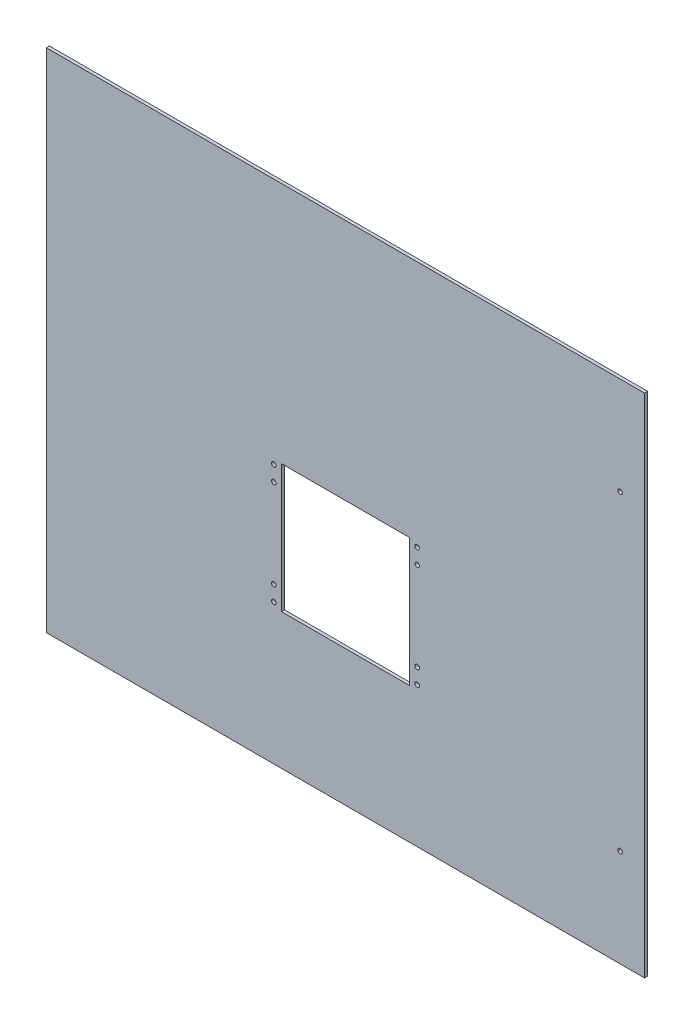
ISO-10303-21;
HEADER;
FILE_DESCRIPTION(('STEP AP214'),'2;1');
FILE_NAME('part.step','',(''),(''),'','','');
FILE_SCHEMA(('AUTOMOTIVE_DESIGN { 1 0 10303 214 1 1 1 1 }'));
ENDSEC;
DATA;
#1=APPLICATION_CONTEXT('core data for automotive mechanical design processes');
#2=APPLICATION_PROTOCOL_DEFINITION('international standard','automotive_design',2000,#1);
#3=PRODUCT_CONTEXT('',#1,'mechanical');
#4=PRODUCT('Part','Part','',(#3));
#5=PRODUCT_RELATED_PRODUCT_CATEGORY('part','',(#4));
#6=PRODUCT_DEFINITION_FORMATION('','',#4);
#7=PRODUCT_DEFINITION_CONTEXT('part definition',#1,'design');
#8=PRODUCT_DEFINITION('design','',#6,#7);
#9=PRODUCT_DEFINITION_SHAPE('','',#8);
#10=(LENGTH_UNIT() NAMED_UNIT(*) SI_UNIT(.MILLI.,.METRE.));
#11=(NAMED_UNIT(*) PLANE_ANGLE_UNIT() SI_UNIT($,.RADIAN.));
#12=(NAMED_UNIT(*) SI_UNIT($,.STERADIAN.) SOLID_ANGLE_UNIT());
#13=UNCERTAINTY_MEASURE_WITH_UNIT(LENGTH_MEASURE(1.E-05),#10,'distance_accuracy_value','');
#14=(GEOMETRIC_REPRESENTATION_CONTEXT(3) GLOBAL_UNCERTAINTY_ASSIGNED_CONTEXT((#13)) GLOBAL_UNIT_ASSIGNED_CONTEXT((#10,
#11,#12)) REPRESENTATION_CONTEXT('',''));
#15=CARTESIAN_POINT('',(0.,0.,0.));
#16=DIRECTION('',(0.,0.,1.));
#17=DIRECTION('',(1.,0.,0.));
#18=AXIS2_PLACEMENT_3D('',#15,#16,#17);
#19=CARTESIAN_POINT('',(0.,0.,6.35));
#20=DIRECTION('',(0.,0.,1.));
#21=DIRECTION('',(1.,0.,0.));
#22=AXIS2_PLACEMENT_3D('',#19,#20,#21);
#23=PLANE('',#22);
#24=CARTESIAN_POINT('',(571.5,323.85,6.35));
#25=DIRECTION('',(0.,0.,1.));
#26=DIRECTION('',(1.,0.,0.));
#27=AXIS2_PLACEMENT_3D('',#24,#25,#26);
#28=CIRCLE('',#27,4.7625);
#29=CARTESIAN_POINT('',(576.2625,323.85,6.35));
#30=VERTEX_POINT('',#29);
#31=EDGE_CURVE('E136',#30,#30,#28,.F.);
#32=ORIENTED_EDGE('',*,*,#31,.T.);
#33=EDGE_LOOP('',(#32));
#34=FACE_BOUND('',#33,.T.);
#35=CARTESIAN_POINT('',(571.5,-323.85,6.35));
#36=DIRECTION('',(0.,0.,1.));
#37=DIRECTION('',(1.,0.,0.));
#38=AXIS2_PLACEMENT_3D('',#35,#36,#37);
#39=CIRCLE('',#38,4.7625);
#40=CARTESIAN_POINT('',(576.2625,-323.85,6.35));
#41=VERTEX_POINT('',#40);
#42=EDGE_CURVE('E139',#41,#41,#39,.F.);
#43=ORIENTED_EDGE('',*,*,#42,.T.);
#44=EDGE_LOOP('',(#43));
#45=FACE_BOUND('',#44,.T.);
#46=CARTESIAN_POINT('',(149.225,-19.05,6.35));
#47=DIRECTION('',(0.,0.,-1.));
#48=DIRECTION('',(-1.,0.,0.));
#49=AXIS2_PLACEMENT_3D('',#46,#47,#48);
#50=CIRCLE('',#49,4.7625);
#51=CARTESIAN_POINT('',(144.4625,-19.05,6.35));
#52=VERTEX_POINT('',#51);
#53=EDGE_CURVE('E142',#52,#52,#50,.T.);
#54=ORIENTED_EDGE('',*,*,#53,.T.);
#55=EDGE_LOOP('',(#54));
#56=FACE_BOUND('',#55,.T.);
#57=CARTESIAN_POINT('',(149.225,12.7,6.35));
#58=DIRECTION('',(0.,0.,-1.));
#59=DIRECTION('',(-1.,0.,0.));
#60=AXIS2_PLACEMENT_3D('',#57,#58,#59);
#61=CIRCLE('',#60,4.7625);
#62=CARTESIAN_POINT('',(144.4625,12.7,6.35));
#63=VERTEX_POINT('',#62);
#64=EDGE_CURVE('E145',#63,#63,#61,.T.);
#65=ORIENTED_EDGE('',*,*,#64,.T.);
#66=EDGE_LOOP('',(#65));
#67=FACE_BOUND('',#66,.T.);
#68=CARTESIAN_POINT('',(149.225,-203.2,6.35));
#69=DIRECTION('',(0.,0.,-1.));
#70=DIRECTION('',(-1.,0.,0.));
#71=AXIS2_PLACEMENT_3D('',#68,#69,#70);
#72=CIRCLE('',#71,4.7625);
#73=CARTESIAN_POINT('',(144.4625,-203.2,6.35));
#74=VERTEX_POINT('',#73);
#75=EDGE_CURVE('E148',#74,#74,#72,.T.);
#76=ORIENTED_EDGE('',*,*,#75,.T.);
#77=EDGE_LOOP('',(#76));
#78=FACE_BOUND('',#77,.T.);
#79=CARTESIAN_POINT('',(149.225,-234.95,6.35));
#80=DIRECTION('',(0.,0.,-1.));
#81=DIRECTION('',(-1.,0.,0.));
#82=AXIS2_PLACEMENT_3D('',#79,#80,#81);
#83=CIRCLE('',#82,4.7625);
#84=CARTESIAN_POINT('',(144.4625,-234.95,6.35));
#85=VERTEX_POINT('',#84);
#86=EDGE_CURVE('E151',#85,#85,#83,.T.);
#87=ORIENTED_EDGE('',*,*,#86,.T.);
#88=EDGE_LOOP('',(#87));
#89=FACE_BOUND('',#88,.T.);
#90=CARTESIAN_POINT('',(-149.225,-19.05,6.35));
#91=DIRECTION('',(0.,0.,1.));
#92=DIRECTION('',(1.,0.,0.));
#93=AXIS2_PLACEMENT_3D('',#90,#91,#92);
#94=CIRCLE('',#93,4.7625);
#95=CARTESIAN_POINT('',(-144.4625,-19.05,6.35));
#96=VERTEX_POINT('',#95);
#97=EDGE_CURVE('E154',#96,#96,#94,.F.);
#98=ORIENTED_EDGE('',*,*,#97,.T.);
#99=EDGE_LOOP('',(#98));
#100=FACE_BOUND('',#99,.T.);
#101=CARTESIAN_POINT('',(-149.225,12.7,6.35));
#102=DIRECTION('',(0.,0.,1.));
#103=DIRECTION('',(1.,0.,0.));
#104=AXIS2_PLACEMENT_3D('',#101,#102,#103);
#105=CIRCLE('',#104,4.7625);
#106=CARTESIAN_POINT('',(-144.4625,12.7,6.35));
#107=VERTEX_POINT('',#106);
#108=EDGE_CURVE('E157',#107,#107,#105,.F.);
#109=ORIENTED_EDGE('',*,*,#108,.T.);
#110=EDGE_LOOP('',(#109));
#111=FACE_BOUND('',#110,.T.);
#112=CARTESIAN_POINT('',(-149.225,-203.2,6.35));
#113=DIRECTION('',(0.,0.,1.));
#114=DIRECTION('',(1.,0.,0.));
#115=AXIS2_PLACEMENT_3D('',#112,#113,#114);
#116=CIRCLE('',#115,4.7625);
#117=CARTESIAN_POINT('',(-144.4625,-203.2,6.35));
#118=VERTEX_POINT('',#117);
#119=EDGE_CURVE('E159',#118,#118,#116,.F.);
#120=ORIENTED_EDGE('',*,*,#119,.T.);
#121=EDGE_LOOP('',(#120));
#122=FACE_BOUND('',#121,.T.);
#123=CARTESIAN_POINT('',(-149.225,-234.95,6.35));
#124=DIRECTION('',(0.,0.,1.));
#125=DIRECTION('',(1.,0.,0.));
#126=AXIS2_PLACEMENT_3D('',#123,#124,#125);
#127=CIRCLE('',#126,4.7625);
#128=CARTESIAN_POINT('',(-144.4625,-234.95,6.35));
#129=VERTEX_POINT('',#128);
#130=EDGE_CURVE('E20',#129,#129,#127,.F.);
#131=ORIENTED_EDGE('',*,*,#130,.T.);
#132=EDGE_LOOP('',(#131));
#133=FACE_BOUND('',#132,.T.);
#134=DIRECTION('',(1.,0.,0.));
#135=VECTOR('',#134,1.);
#136=CARTESIAN_POINT('',(-133.35,-244.475,6.35));
#137=LINE('',#136,#135);
#138=CARTESIAN_POINT('',(133.35,-244.475,6.35));
#139=VERTEX_POINT('',#138);
#140=CARTESIAN_POINT('',(-133.35,-244.475,6.35));
#141=VERTEX_POINT('',#140);
#142=EDGE_CURVE('E168',#139,#141,#137,.F.);
#143=ORIENTED_EDGE('',*,*,#142,.T.);
#144=DIRECTION('',(0.,1.,0.));
#145=VECTOR('',#144,1.);
#146=CARTESIAN_POINT('',(-133.35,22.225,6.35));
#147=LINE('',#146,#145);
#148=CARTESIAN_POINT('',(-133.35,22.225,6.35));
#149=VERTEX_POINT('',#148);
#150=EDGE_CURVE('E189',#141,#149,#147,.T.);
#151=ORIENTED_EDGE('',*,*,#150,.T.);
#152=DIRECTION('',(1.,0.,0.));
#153=VECTOR('',#152,1.);
#154=CARTESIAN_POINT('',(133.35,22.225,6.35));
#155=LINE('',#154,#153);
#156=CARTESIAN_POINT('',(133.35,22.225,6.35));
#157=VERTEX_POINT('',#156);
#158=EDGE_CURVE('E184',#149,#157,#155,.T.);
#159=ORIENTED_EDGE('',*,*,#158,.T.);
#160=DIRECTION('',(0.,1.,0.));
#161=VECTOR('',#160,1.);
#162=CARTESIAN_POINT('',(133.35,-244.475,6.35));
#163=LINE('',#162,#161);
#164=EDGE_CURVE('E179',#157,#139,#163,.F.);
#165=ORIENTED_EDGE('',*,*,#164,.T.);
#166=EDGE_LOOP('',(#143,#151,#159,#165));
#167=FACE_BOUND('',#166,.T.);
#168=DIRECTION('',(1.,0.,0.));
#169=VECTOR('',#168,1.);
#170=CARTESIAN_POINT('',(622.3,527.05,6.35));
#171=LINE('',#170,#169);
#172=CARTESIAN_POINT('',(-622.3,527.05,6.35));
#173=VERTEX_POINT('',#172);
#174=CARTESIAN_POINT('',(622.3,527.05,6.35));
#175=VERTEX_POINT('',#174);
#176=EDGE_CURVE('E97',#173,#175,#171,.T.);
#177=ORIENTED_EDGE('',*,*,#176,.F.);
#178=DIRECTION('',(0.,1.,0.));
#179=VECTOR('',#178,1.);
#180=CARTESIAN_POINT('',(-622.3,527.05,6.35));
#181=LINE('',#180,#179);
#182=CARTESIAN_POINT('',(-622.3,-527.05,6.35));
#183=VERTEX_POINT('',#182);
#184=EDGE_CURVE('E94',#183,#173,#181,.T.);
#185=ORIENTED_EDGE('',*,*,#184,.F.);
#186=DIRECTION('',(1.,0.,0.));
#187=VECTOR('',#186,1.);
#188=CARTESIAN_POINT('',(-622.3,-527.05,6.35));
#189=LINE('',#188,#187);
#190=CARTESIAN_POINT('',(622.3,-527.05,6.35));
#191=VERTEX_POINT('',#190);
#192=EDGE_CURVE('E85',#191,#183,#189,.F.);
#193=ORIENTED_EDGE('',*,*,#192,.F.);
#194=DIRECTION('',(0.,1.,0.));
#195=VECTOR('',#194,1.);
#196=CARTESIAN_POINT('',(622.3,-527.05,6.35));
#197=LINE('',#196,#195);
#198=EDGE_CURVE('E80',#175,#191,#197,.F.);
#199=ORIENTED_EDGE('',*,*,#198,.F.);
#200=EDGE_LOOP('',(#177,#185,#193,#199));
#201=FACE_BOUND('',#200,.T.);
#202=ADVANCED_FACE('F17',(#34,#45,#56,#67,#78,#89,#100,#111,#122,#133,#167,#201),#23,.T.);
#203=CARTESIAN_POINT('',(-622.3,527.05,0.));
#204=DIRECTION('',(-1.,0.,0.));
#205=DIRECTION('',(0.,0.,1.));
#206=AXIS2_PLACEMENT_3D('',#203,#204,#205);
#207=PLANE('',#206);
#208=DIRECTION('',(0.,0.,1.));
#209=VECTOR('',#208,1.);
#210=CARTESIAN_POINT('',(-622.3,527.05,0.));
#211=LINE('',#210,#209);
#212=CARTESIAN_POINT('',(-622.3,527.05,0.));
#213=VERTEX_POINT('',#212);
#214=EDGE_CURVE('E194',#213,#173,#211,.T.);
#215=ORIENTED_EDGE('',*,*,#214,.F.);
#216=DIRECTION('',(0.,1.,0.));
#217=VECTOR('',#216,1.);
#218=CARTESIAN_POINT('',(-622.3,0.,0.));
#219=LINE('',#218,#217);
#220=CARTESIAN_POINT('',(-622.3,-527.05,0.));
#221=VERTEX_POINT('',#220);
#222=EDGE_CURVE('E104',#213,#221,#219,.F.);
#223=ORIENTED_EDGE('',*,*,#222,.T.);
#224=DIRECTION('',(0.,0.,-1.));
#225=VECTOR('',#224,1.);
#226=CARTESIAN_POINT('',(-622.3,-527.05,0.));
#227=LINE('',#226,#225);
#228=EDGE_CURVE('E90',#183,#221,#227,.T.);
#229=ORIENTED_EDGE('',*,*,#228,.F.);
#230=ORIENTED_EDGE('',*,*,#184,.T.);
#231=EDGE_LOOP('',(#215,#223,#229,#230));
#232=FACE_BOUND('',#231,.T.);
#233=ADVANCED_FACE('F103',(#232),#207,.T.);
#234=CARTESIAN_POINT('',(-622.3,-527.05,0.));
#235=DIRECTION('',(0.,-1.,0.));
#236=DIRECTION('',(0.,0.,-1.));
#237=AXIS2_PLACEMENT_3D('',#234,#235,#236);
#238=PLANE('',#237);
#239=ORIENTED_EDGE('',*,*,#228,.T.);
#240=DIRECTION('',(1.,0.,0.));
#241=VECTOR('',#240,1.);
#242=CARTESIAN_POINT('',(0.,-527.05,0.));
#243=LINE('',#242,#241);
#244=CARTESIAN_POINT('',(622.3,-527.05,0.));
#245=VERTEX_POINT('',#244);
#246=EDGE_CURVE('E202',#221,#245,#243,.T.);
#247=ORIENTED_EDGE('',*,*,#246,.T.);
#248=DIRECTION('',(0.,0.,-1.));
#249=VECTOR('',#248,1.);
#250=CARTESIAN_POINT('',(622.3,-527.05,0.));
#251=LINE('',#250,#249);
#252=EDGE_CURVE('E92',#191,#245,#251,.T.);
#253=ORIENTED_EDGE('',*,*,#252,.F.);
#254=ORIENTED_EDGE('',*,*,#192,.T.);
#255=EDGE_LOOP('',(#239,#247,#253,#254));
#256=FACE_BOUND('',#255,.T.);
#257=ADVANCED_FACE('F87',(#256),#238,.T.);
#258=CARTESIAN_POINT('',(622.3,-527.05,0.));
#259=DIRECTION('',(1.,0.,0.));
#260=DIRECTION('',(0.,0.,-1.));
#261=AXIS2_PLACEMENT_3D('',#258,#259,#260);
#262=PLANE('',#261);
#263=ORIENTED_EDGE('',*,*,#252,.T.);
#264=DIRECTION('',(0.,1.,0.));
#265=VECTOR('',#264,1.);
#266=CARTESIAN_POINT('',(622.3,0.,0.));
#267=LINE('',#266,#265);
#268=CARTESIAN_POINT('',(622.3,527.05,0.));
#269=VERTEX_POINT('',#268);
#270=EDGE_CURVE('E198',#245,#269,#267,.T.);
#271=ORIENTED_EDGE('',*,*,#270,.T.);
#272=DIRECTION('',(0.,0.,1.));
#273=VECTOR('',#272,1.);
#274=CARTESIAN_POINT('',(622.3,527.05,0.));
#275=LINE('',#274,#273);
#276=EDGE_CURVE('E191',#175,#269,#275,.F.);
#277=ORIENTED_EDGE('',*,*,#276,.F.);
#278=ORIENTED_EDGE('',*,*,#198,.T.);
#279=EDGE_LOOP('',(#263,#271,#277,#278));
#280=FACE_BOUND('',#279,.T.);
#281=ADVANCED_FACE('F197',(#280),#262,.T.);
#282=CARTESIAN_POINT('',(622.3,527.05,0.));
#283=DIRECTION('',(0.,1.,0.));
#284=DIRECTION('',(0.,0.,1.));
#285=AXIS2_PLACEMENT_3D('',#282,#283,#284);
#286=PLANE('',#285);
#287=ORIENTED_EDGE('',*,*,#276,.T.);
#288=DIRECTION('',(1.,0.,0.));
#289=VECTOR('',#288,1.);
#290=CARTESIAN_POINT('',(0.,527.05,0.));
#291=LINE('',#290,#289);
#292=EDGE_CURVE('E204',#269,#213,#291,.F.);
#293=ORIENTED_EDGE('',*,*,#292,.T.);
#294=ORIENTED_EDGE('',*,*,#214,.T.);
#295=ORIENTED_EDGE('',*,*,#176,.T.);
#296=EDGE_LOOP('',(#287,#293,#294,#295));
#297=FACE_BOUND('',#296,.T.);
#298=ADVANCED_FACE('F291',(#297),#286,.T.);
#299=CARTESIAN_POINT('',(-133.35,22.225,6.35));
#300=DIRECTION('',(-1.,0.,0.));
#301=DIRECTION('',(0.,0.,1.));
#302=AXIS2_PLACEMENT_3D('',#299,#300,#301);
#303=PLANE('',#302);
#304=ORIENTED_EDGE('',*,*,#150,.F.);
#305=DIRECTION('',(0.,0.,-1.));
#306=VECTOR('',#305,1.);
#307=CARTESIAN_POINT('',(-133.35,-244.475,6.35));
#308=LINE('',#307,#306);
#309=CARTESIAN_POINT('',(-133.35,-244.475,0.));
#310=VERTEX_POINT('',#309);
#311=EDGE_CURVE('E164',#141,#310,#308,.T.);
#312=ORIENTED_EDGE('',*,*,#311,.T.);
#313=DIRECTION('',(0.,1.,0.));
#314=VECTOR('',#313,1.);
#315=CARTESIAN_POINT('',(-133.35,0.,0.));
#316=LINE('',#315,#314);
#317=CARTESIAN_POINT('',(-133.35,22.225,0.));
#318=VERTEX_POINT('',#317);
#319=EDGE_CURVE('E208',#310,#318,#316,.T.);
#320=ORIENTED_EDGE('',*,*,#319,.T.);
#321=DIRECTION('',(0.,0.,1.));
#322=VECTOR('',#321,1.);
#323=CARTESIAN_POINT('',(-133.35,22.225,6.35));
#324=LINE('',#323,#322);
#325=EDGE_CURVE('E186',#318,#149,#324,.T.);
#326=ORIENTED_EDGE('',*,*,#325,.T.);
#327=EDGE_LOOP('',(#304,#312,#320,#326));
#328=FACE_BOUND('',#327,.T.);
#329=ADVANCED_FACE('F226',(#328),#303,.F.);
#330=CARTESIAN_POINT('',(133.35,22.225,6.35));
#331=DIRECTION('',(0.,1.,0.));
#332=DIRECTION('',(0.,0.,1.));
#333=AXIS2_PLACEMENT_3D('',#330,#331,#332);
#334=PLANE('',#333);
#335=ORIENTED_EDGE('',*,*,#158,.F.);
#336=ORIENTED_EDGE('',*,*,#325,.F.);
#337=DIRECTION('',(1.,0.,0.));
#338=VECTOR('',#337,1.);
#339=CARTESIAN_POINT('',(0.,22.225,0.));
#340=LINE('',#339,#338);
#341=CARTESIAN_POINT('',(133.35,22.225,0.));
#342=VERTEX_POINT('',#341);
#343=EDGE_CURVE('E210',#318,#342,#340,.T.);
#344=ORIENTED_EDGE('',*,*,#343,.T.);
#345=DIRECTION('',(0.,0.,-1.));
#346=VECTOR('',#345,1.);
#347=CARTESIAN_POINT('',(133.35,22.225,6.35));
#348=LINE('',#347,#346);
#349=EDGE_CURVE('E181',#342,#157,#348,.F.);
#350=ORIENTED_EDGE('',*,*,#349,.T.);
#351=EDGE_LOOP('',(#335,#336,#344,#350));
#352=FACE_BOUND('',#351,.T.);
#353=ADVANCED_FACE('F225',(#352),#334,.F.);
#354=CARTESIAN_POINT('',(133.35,-244.475,6.35));
#355=DIRECTION('',(1.,0.,0.));
#356=DIRECTION('',(0.,0.,-1.));
#357=AXIS2_PLACEMENT_3D('',#354,#355,#356);
#358=PLANE('',#357);
#359=ORIENTED_EDGE('',*,*,#164,.F.);
#360=ORIENTED_EDGE('',*,*,#349,.F.);
#361=DIRECTION('',(0.,1.,0.));
#362=VECTOR('',#361,1.);
#363=CARTESIAN_POINT('',(133.35,0.,0.));
#364=LINE('',#363,#362);
#365=CARTESIAN_POINT('',(133.35,-244.475,0.));
#366=VERTEX_POINT('',#365);
#367=EDGE_CURVE('E213',#342,#366,#364,.F.);
#368=ORIENTED_EDGE('',*,*,#367,.T.);
#369=DIRECTION('',(0.,0.,-1.));
#370=VECTOR('',#369,1.);
#371=CARTESIAN_POINT('',(133.35,-244.475,6.35));
#372=LINE('',#371,#370);
#373=EDGE_CURVE('E35',#366,#139,#372,.F.);
#374=ORIENTED_EDGE('',*,*,#373,.T.);
#375=EDGE_LOOP('',(#359,#360,#368,#374));
#376=FACE_BOUND('',#375,.T.);
#377=ADVANCED_FACE('F222',(#376),#358,.F.);
#378=CARTESIAN_POINT('',(-133.35,-244.475,6.35));
#379=DIRECTION('',(0.,-1.,0.));
#380=DIRECTION('',(0.,0.,-1.));
#381=AXIS2_PLACEMENT_3D('',#378,#379,#380);
#382=PLANE('',#381);
#383=ORIENTED_EDGE('',*,*,#142,.F.);
#384=ORIENTED_EDGE('',*,*,#373,.F.);
#385=DIRECTION('',(1.,0.,0.));
#386=VECTOR('',#385,1.);
#387=CARTESIAN_POINT('',(0.,-244.475,0.));
#388=LINE('',#387,#386);
#389=EDGE_CURVE('E135',#366,#310,#388,.F.);
#390=ORIENTED_EDGE('',*,*,#389,.T.);
#391=ORIENTED_EDGE('',*,*,#311,.F.);
#392=EDGE_LOOP('',(#383,#384,#390,#391));
#393=FACE_BOUND('',#392,.T.);
#394=ADVANCED_FACE('F216',(#393),#382,.F.);
#395=CARTESIAN_POINT('',(-149.225,-234.95,0.));
#396=DIRECTION('',(0.,0.,1.));
#397=DIRECTION('',(1.,0.,0.));
#398=AXIS2_PLACEMENT_3D('',#395,#396,#397);
#399=CYLINDRICAL_SURFACE('',#398,4.7625);
#400=ORIENTED_EDGE('',*,*,#130,.F.);
#401=EDGE_LOOP('',(#400));
#402=FACE_BOUND('',#401,.T.);
#403=CARTESIAN_POINT('',(-149.225,-234.95,0.));
#404=DIRECTION('',(0.,0.,1.));
#405=DIRECTION('',(1.,0.,0.));
#406=AXIS2_PLACEMENT_3D('',#403,#404,#405);
#407=CIRCLE('',#406,4.7625);
#408=CARTESIAN_POINT('',(-144.4625,-234.95,0.));
#409=VERTEX_POINT('',#408);
#410=EDGE_CURVE('E132',#409,#409,#407,.F.);
#411=ORIENTED_EDGE('',*,*,#410,.T.);
#412=EDGE_LOOP('',(#411));
#413=FACE_BOUND('',#412,.T.);
#414=ADVANCED_FACE('F278',(#402,#413),#399,.F.);
#415=CARTESIAN_POINT('',(-149.225,-203.2,0.));
#416=DIRECTION('',(0.,0.,1.));
#417=DIRECTION('',(1.,0.,0.));
#418=AXIS2_PLACEMENT_3D('',#415,#416,#417);
#419=CYLINDRICAL_SURFACE('',#418,4.7625);
#420=ORIENTED_EDGE('',*,*,#119,.F.);
#421=EDGE_LOOP('',(#420));
#422=FACE_BOUND('',#421,.T.);
#423=CARTESIAN_POINT('',(-149.225,-203.2,0.));
#424=DIRECTION('',(0.,0.,1.));
#425=DIRECTION('',(1.,0.,0.));
#426=AXIS2_PLACEMENT_3D('',#423,#424,#425);
#427=CIRCLE('',#426,4.7625);
#428=CARTESIAN_POINT('',(-144.4625,-203.2,0.));
#429=VERTEX_POINT('',#428);
#430=EDGE_CURVE('E129',#429,#429,#427,.F.);
#431=ORIENTED_EDGE('',*,*,#430,.T.);
#432=EDGE_LOOP('',(#431));
#433=FACE_BOUND('',#432,.T.);
#434=ADVANCED_FACE('F274',(#422,#433),#419,.F.);
#435=CARTESIAN_POINT('',(-149.225,12.7,0.));
#436=DIRECTION('',(0.,0.,1.));
#437=DIRECTION('',(1.,0.,0.));
#438=AXIS2_PLACEMENT_3D('',#435,#436,#437);
#439=CYLINDRICAL_SURFACE('',#438,4.7625);
#440=ORIENTED_EDGE('',*,*,#108,.F.);
#441=EDGE_LOOP('',(#440));
#442=FACE_BOUND('',#441,.T.);
#443=CARTESIAN_POINT('',(-149.225,12.7,0.));
#444=DIRECTION('',(0.,0.,1.));
#445=DIRECTION('',(1.,0.,0.));
#446=AXIS2_PLACEMENT_3D('',#443,#444,#445);
#447=CIRCLE('',#446,4.7625);
#448=CARTESIAN_POINT('',(-144.4625,12.7,0.));
#449=VERTEX_POINT('',#448);
#450=EDGE_CURVE('E126',#449,#449,#447,.F.);
#451=ORIENTED_EDGE('',*,*,#450,.T.);
#452=EDGE_LOOP('',(#451));
#453=FACE_BOUND('',#452,.T.);
#454=ADVANCED_FACE('F270',(#442,#453),#439,.F.);
#455=CARTESIAN_POINT('',(-149.225,-19.05,0.));
#456=DIRECTION('',(0.,0.,1.));
#457=DIRECTION('',(1.,0.,0.));
#458=AXIS2_PLACEMENT_3D('',#455,#456,#457);
#459=CYLINDRICAL_SURFACE('',#458,4.7625);
#460=ORIENTED_EDGE('',*,*,#97,.F.);
#461=EDGE_LOOP('',(#460));
#462=FACE_BOUND('',#461,.T.);
#463=CARTESIAN_POINT('',(-149.225,-19.05,0.));
#464=DIRECTION('',(0.,0.,1.));
#465=DIRECTION('',(1.,0.,0.));
#466=AXIS2_PLACEMENT_3D('',#463,#464,#465);
#467=CIRCLE('',#466,4.7625);
#468=CARTESIAN_POINT('',(-144.4625,-19.05,0.));
#469=VERTEX_POINT('',#468);
#470=EDGE_CURVE('E123',#469,#469,#467,.F.);
#471=ORIENTED_EDGE('',*,*,#470,.T.);
#472=EDGE_LOOP('',(#471));
#473=FACE_BOUND('',#472,.T.);
#474=ADVANCED_FACE('F266',(#462,#473),#459,.F.);
#475=CARTESIAN_POINT('',(149.225,-234.95,0.));
#476=DIRECTION('',(0.,0.,-1.));
#477=DIRECTION('',(-1.,0.,0.));
#478=AXIS2_PLACEMENT_3D('',#475,#476,#477);
#479=CYLINDRICAL_SURFACE('',#478,4.7625);
#480=CARTESIAN_POINT('',(149.225,-234.95,0.));
#481=DIRECTION('',(0.,0.,-1.));
#482=DIRECTION('',(-1.,0.,0.));
#483=AXIS2_PLACEMENT_3D('',#480,#481,#482);
#484=CIRCLE('',#483,4.7625);
#485=CARTESIAN_POINT('',(144.4625,-234.95,0.));
#486=VERTEX_POINT('',#485);
#487=EDGE_CURVE('E120',#486,#486,#484,.T.);
#488=ORIENTED_EDGE('',*,*,#487,.T.);
#489=EDGE_LOOP('',(#488));
#490=FACE_BOUND('',#489,.T.);
#491=ORIENTED_EDGE('',*,*,#86,.F.);
#492=EDGE_LOOP('',(#491));
#493=FACE_BOUND('',#492,.T.);
#494=ADVANCED_FACE('F262',(#490,#493),#479,.F.);
#495=CARTESIAN_POINT('',(149.225,-203.2,0.));
#496=DIRECTION('',(0.,0.,-1.));
#497=DIRECTION('',(-1.,0.,0.));
#498=AXIS2_PLACEMENT_3D('',#495,#496,#497);
#499=CYLINDRICAL_SURFACE('',#498,4.7625);
#500=CARTESIAN_POINT('',(149.225,-203.2,0.));
#501=DIRECTION('',(0.,0.,-1.));
#502=DIRECTION('',(-1.,0.,0.));
#503=AXIS2_PLACEMENT_3D('',#500,#501,#502);
#504=CIRCLE('',#503,4.7625);
#505=CARTESIAN_POINT('',(144.4625,-203.2,0.));
#506=VERTEX_POINT('',#505);
#507=EDGE_CURVE('E117',#506,#506,#504,.T.);
#508=ORIENTED_EDGE('',*,*,#507,.T.);
#509=EDGE_LOOP('',(#508));
#510=FACE_BOUND('',#509,.T.);
#511=ORIENTED_EDGE('',*,*,#75,.F.);
#512=EDGE_LOOP('',(#511));
#513=FACE_BOUND('',#512,.T.);
#514=ADVANCED_FACE('F258',(#510,#513),#499,.F.);
#515=CARTESIAN_POINT('',(149.225,12.7,0.));
#516=DIRECTION('',(0.,0.,-1.));
#517=DIRECTION('',(-1.,0.,0.));
#518=AXIS2_PLACEMENT_3D('',#515,#516,#517);
#519=CYLINDRICAL_SURFACE('',#518,4.7625);
#520=CARTESIAN_POINT('',(149.225,12.7,0.));
#521=DIRECTION('',(0.,0.,-1.));
#522=DIRECTION('',(-1.,0.,0.));
#523=AXIS2_PLACEMENT_3D('',#520,#521,#522);
#524=CIRCLE('',#523,4.7625);
#525=CARTESIAN_POINT('',(144.4625,12.7,0.));
#526=VERTEX_POINT('',#525);
#527=EDGE_CURVE('E114',#526,#526,#524,.T.);
#528=ORIENTED_EDGE('',*,*,#527,.T.);
#529=EDGE_LOOP('',(#528));
#530=FACE_BOUND('',#529,.T.);
#531=ORIENTED_EDGE('',*,*,#64,.F.);
#532=EDGE_LOOP('',(#531));
#533=FACE_BOUND('',#532,.T.);
#534=ADVANCED_FACE('F254',(#530,#533),#519,.F.);
#535=CARTESIAN_POINT('',(149.225,-19.05,0.));
#536=DIRECTION('',(0.,0.,-1.));
#537=DIRECTION('',(-1.,0.,0.));
#538=AXIS2_PLACEMENT_3D('',#535,#536,#537);
#539=CYLINDRICAL_SURFACE('',#538,4.7625);
#540=CARTESIAN_POINT('',(149.225,-19.05,0.));
#541=DIRECTION('',(0.,0.,-1.));
#542=DIRECTION('',(-1.,0.,0.));
#543=AXIS2_PLACEMENT_3D('',#540,#541,#542);
#544=CIRCLE('',#543,4.7625);
#545=CARTESIAN_POINT('',(144.4625,-19.05,0.));
#546=VERTEX_POINT('',#545);
#547=EDGE_CURVE('E111',#546,#546,#544,.T.);
#548=ORIENTED_EDGE('',*,*,#547,.T.);
#549=EDGE_LOOP('',(#548));
#550=FACE_BOUND('',#549,.T.);
#551=ORIENTED_EDGE('',*,*,#53,.F.);
#552=EDGE_LOOP('',(#551));
#553=FACE_BOUND('',#552,.T.);
#554=ADVANCED_FACE('F250',(#550,#553),#539,.F.);
#555=CARTESIAN_POINT('',(571.5,-323.85,0.));
#556=DIRECTION('',(0.,0.,1.));
#557=DIRECTION('',(1.,0.,0.));
#558=AXIS2_PLACEMENT_3D('',#555,#556,#557);
#559=CYLINDRICAL_SURFACE('',#558,4.7625);
#560=ORIENTED_EDGE('',*,*,#42,.F.);
#561=EDGE_LOOP('',(#560));
#562=FACE_BOUND('',#561,.T.);
#563=CARTESIAN_POINT('',(571.5,-323.85,0.));
#564=DIRECTION('',(0.,0.,1.));
#565=DIRECTION('',(1.,0.,0.));
#566=AXIS2_PLACEMENT_3D('',#563,#564,#565);
#567=CIRCLE('',#566,4.7625);
#568=CARTESIAN_POINT('',(576.2625,-323.85,0.));
#569=VERTEX_POINT('',#568);
#570=EDGE_CURVE('E26',#569,#569,#567,.F.);
#571=ORIENTED_EDGE('',*,*,#570,.T.);
#572=EDGE_LOOP('',(#571));
#573=FACE_BOUND('',#572,.T.);
#574=ADVANCED_FACE('F242',(#562,#573),#559,.F.);
#575=CARTESIAN_POINT('',(571.5,323.85,0.));
#576=DIRECTION('',(0.,0.,1.));
#577=DIRECTION('',(1.,0.,0.));
#578=AXIS2_PLACEMENT_3D('',#575,#576,#577);
#579=CYLINDRICAL_SURFACE('',#578,4.7625);
#580=ORIENTED_EDGE('',*,*,#31,.F.);
#581=EDGE_LOOP('',(#580));
#582=FACE_BOUND('',#581,.T.);
#583=CARTESIAN_POINT('',(571.5,323.85,0.));
#584=DIRECTION('',(0.,0.,1.));
#585=DIRECTION('',(1.,0.,0.));
#586=AXIS2_PLACEMENT_3D('',#583,#584,#585);
#587=CIRCLE('',#586,4.7625);
#588=CARTESIAN_POINT('',(576.2625,323.85,0.));
#589=VERTEX_POINT('',#588);
#590=EDGE_CURVE('E11',#589,#589,#587,.F.);
#591=ORIENTED_EDGE('',*,*,#590,.T.);
#592=EDGE_LOOP('',(#591));
#593=FACE_BOUND('',#592,.T.);
#594=ADVANCED_FACE('F236',(#582,#593),#579,.F.);
#595=CARTESIAN_POINT('',(0.,0.,0.));
#596=DIRECTION('',(0.,0.,1.));
#597=DIRECTION('',(1.,0.,0.));
#598=AXIS2_PLACEMENT_3D('',#595,#596,#597);
#599=PLANE('',#598);
#600=ORIENTED_EDGE('',*,*,#590,.F.);
#601=EDGE_LOOP('',(#600));
#602=FACE_BOUND('',#601,.T.);
#603=ORIENTED_EDGE('',*,*,#570,.F.);
#604=EDGE_LOOP('',(#603));
#605=FACE_BOUND('',#604,.T.);
#606=ORIENTED_EDGE('',*,*,#547,.F.);
#607=EDGE_LOOP('',(#606));
#608=FACE_BOUND('',#607,.T.);
#609=ORIENTED_EDGE('',*,*,#527,.F.);
#610=EDGE_LOOP('',(#609));
#611=FACE_BOUND('',#610,.T.);
#612=ORIENTED_EDGE('',*,*,#507,.F.);
#613=EDGE_LOOP('',(#612));
#614=FACE_BOUND('',#613,.T.);
#615=ORIENTED_EDGE('',*,*,#487,.F.);
#616=EDGE_LOOP('',(#615));
#617=FACE_BOUND('',#616,.T.);
#618=ORIENTED_EDGE('',*,*,#470,.F.);
#619=EDGE_LOOP('',(#618));
#620=FACE_BOUND('',#619,.T.);
#621=ORIENTED_EDGE('',*,*,#450,.F.);
#622=EDGE_LOOP('',(#621));
#623=FACE_BOUND('',#622,.T.);
#624=ORIENTED_EDGE('',*,*,#430,.F.);
#625=EDGE_LOOP('',(#624));
#626=FACE_BOUND('',#625,.T.);
#627=ORIENTED_EDGE('',*,*,#410,.F.);
#628=EDGE_LOOP('',(#627));
#629=FACE_BOUND('',#628,.T.);
#630=ORIENTED_EDGE('',*,*,#367,.F.);
#631=ORIENTED_EDGE('',*,*,#343,.F.);
#632=ORIENTED_EDGE('',*,*,#319,.F.);
#633=ORIENTED_EDGE('',*,*,#389,.F.);
#634=EDGE_LOOP('',(#630,#631,#632,#633));
#635=FACE_BOUND('',#634,.T.);
#636=ORIENTED_EDGE('',*,*,#270,.F.);
#637=ORIENTED_EDGE('',*,*,#246,.F.);
#638=ORIENTED_EDGE('',*,*,#222,.F.);
#639=ORIENTED_EDGE('',*,*,#292,.F.);
#640=EDGE_LOOP('',(#636,#637,#638,#639));
#641=FACE_BOUND('',#640,.T.);
#642=ADVANCED_FACE('F201',(#602,#605,#608,#611,#614,#617,#620,#623,#626,#629,#635,#641),#599,.F.);
#643=CLOSED_SHELL('',(#202,#233,#257,#281,#298,#329,#353,#377,#394,#414,#434,#454,#474,#494,
#514,#534,#554,#574,#594,#642));
#644=MANIFOLD_SOLID_BREP('B1',#643);
#645=ADVANCED_BREP_SHAPE_REPRESENTATION('',(#18,#644),#14);
#646=SHAPE_DEFINITION_REPRESENTATION(#9,#645);
ENDSEC;
END-ISO-10303-21;
